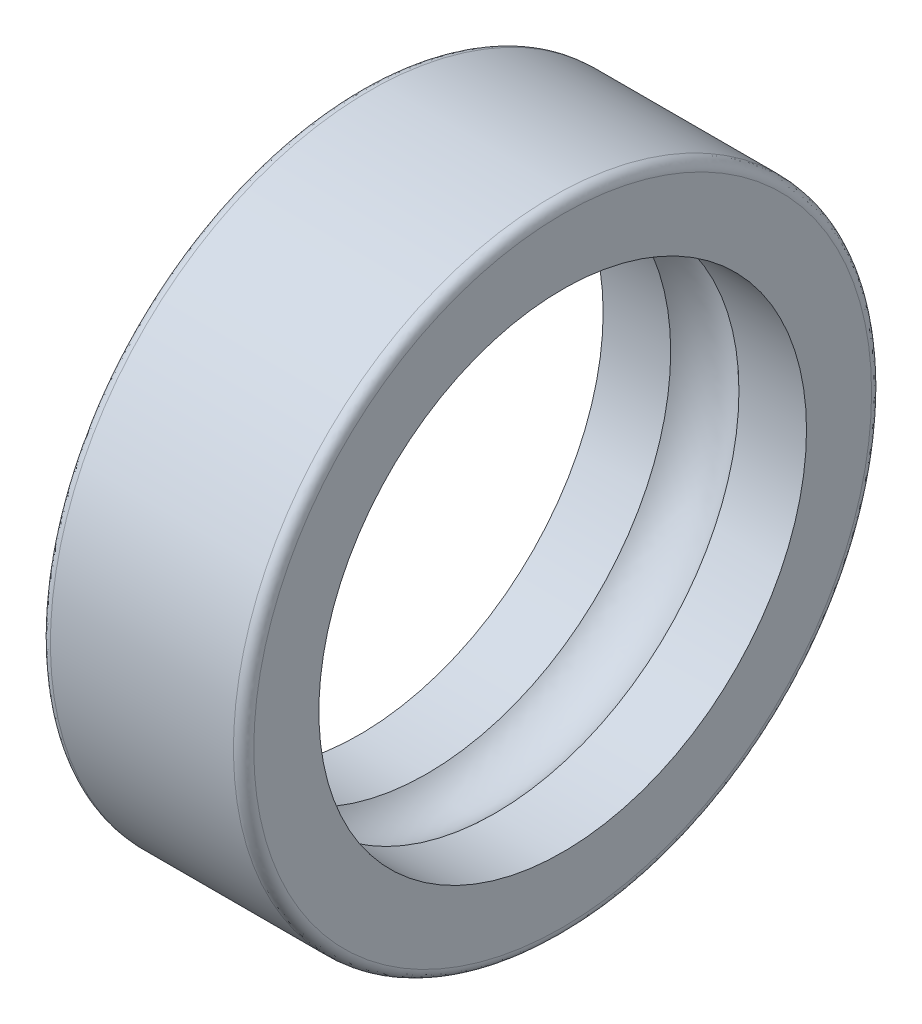
ISO-10303-21;
HEADER;
FILE_DESCRIPTION(('STEP AP214'),'2;1');
FILE_NAME('part.step','',(''),(''),'','','');
FILE_SCHEMA(('AUTOMOTIVE_DESIGN { 1 0 10303 214 1 1 1 1 }'));
ENDSEC;
DATA;
#1=APPLICATION_CONTEXT('core data for automotive mechanical design processes');
#2=APPLICATION_PROTOCOL_DEFINITION('international standard','automotive_design',2000,#1);
#3=PRODUCT_CONTEXT('',#1,'mechanical');
#4=PRODUCT('Part','Part','',(#3));
#5=PRODUCT_RELATED_PRODUCT_CATEGORY('part','',(#4));
#6=PRODUCT_DEFINITION_FORMATION('','',#4);
#7=PRODUCT_DEFINITION_CONTEXT('part definition',#1,'design');
#8=PRODUCT_DEFINITION('design','',#6,#7);
#9=PRODUCT_DEFINITION_SHAPE('','',#8);
#10=(LENGTH_UNIT() NAMED_UNIT(*) SI_UNIT(.MILLI.,.METRE.));
#11=(NAMED_UNIT(*) PLANE_ANGLE_UNIT() SI_UNIT($,.RADIAN.));
#12=(NAMED_UNIT(*) SI_UNIT($,.STERADIAN.) SOLID_ANGLE_UNIT());
#13=UNCERTAINTY_MEASURE_WITH_UNIT(LENGTH_MEASURE(1.E-05),#10,'distance_accuracy_value','');
#14=(GEOMETRIC_REPRESENTATION_CONTEXT(3) GLOBAL_UNCERTAINTY_ASSIGNED_CONTEXT((#13)) GLOBAL_UNIT_ASSIGNED_CONTEXT((#10,
#11,#12)) REPRESENTATION_CONTEXT('',''));
#15=CARTESIAN_POINT('',(0.,0.,0.));
#16=DIRECTION('',(0.,0.,1.));
#17=DIRECTION('',(1.,0.,0.));
#18=AXIS2_PLACEMENT_3D('',#15,#16,#17);
#19=CARTESIAN_POINT('',(-3.15468,0.,0.));
#20=DIRECTION('',(1.,0.,0.));
#21=DIRECTION('',(0.,0.,-1.));
#22=AXIS2_PLACEMENT_3D('',#19,#20,#21);
#23=CYLINDRICAL_SURFACE('',#22,10.9982);
#24=CARTESIAN_POINT('',(3.15468,0.,0.));
#25=DIRECTION('',(1.,0.,0.));
#26=DIRECTION('',(0.,-1.,0.));
#27=AXIS2_PLACEMENT_3D('',#24,#25,#26);
#28=CIRCLE('',#27,10.9982);
#29=CARTESIAN_POINT('',(3.15468,-10.9982,0.));
#30=VERTEX_POINT('',#29);
#31=EDGE_CURVE('E108',#30,#30,#28,.F.);
#32=ORIENTED_EDGE('',*,*,#31,.T.);
#33=EDGE_LOOP('',(#32));
#34=FACE_BOUND('',#33,.T.);
#35=CARTESIAN_POINT('',(-3.15468,0.,0.));
#36=DIRECTION('',(1.,0.,0.));
#37=DIRECTION('',(0.,-1.,0.));
#38=AXIS2_PLACEMENT_3D('',#35,#36,#37);
#39=CIRCLE('',#38,10.9982);
#40=CARTESIAN_POINT('',(-3.15468,-10.9982,0.));
#41=VERTEX_POINT('',#40);
#42=EDGE_CURVE('E53',#41,#41,#39,.T.);
#43=ORIENTED_EDGE('',*,*,#42,.T.);
#44=EDGE_LOOP('',(#43));
#45=FACE_BOUND('',#44,.T.);
#46=ADVANCED_FACE('F16',(#34,#45),#23,.T.);
#47=CARTESIAN_POINT('',(3.11649065283719,-10.9961134142462,0.));
#48=CARTESIAN_POINT('',(3.35786764141765,-11.0225690560909,0.));
#49=CARTESIAN_POINT('',(3.52956905609089,-10.8508676414176,0.));
#50=CARTESIAN_POINT('',(3.50311341424621,-10.6094906528372,0.));
#51=(BOUNDED_CURVE() B_SPLINE_CURVE(3,(#47,#48,#49,#50),.UNSPECIFIED.,.F.,
.F.) B_SPLINE_CURVE_WITH_KNOTS((4,4),(0.,1.),
.UNSPECIFIED.) CURVE() GEOMETRIC_REPRESENTATION_ITEM() RATIONAL_B_SPLINE_CURVE((1.,
0.750571881124367,0.750571881124367,1.)) REPRESENTATION_ITEM(''));
#52=CARTESIAN_POINT('',(3.15468,0.,0.));
#53=DIRECTION('',(1.,0.,0.));
#54=AXIS1_PLACEMENT('',#52,#53);
#55=SURFACE_OF_REVOLUTION('',#51,#54);
#56=ORIENTED_EDGE('',*,*,#31,.F.);
#57=EDGE_LOOP('',(#56));
#58=FACE_BOUND('',#57,.T.);
#59=CARTESIAN_POINT('',(3.50519999999999,0.,0.));
#60=DIRECTION('',(-1.,0.,0.));
#61=DIRECTION('',(0.,1.,0.));
#62=AXIS2_PLACEMENT_3D('',#59,#60,#61);
#63=CIRCLE('',#62,10.64768);
#64=CARTESIAN_POINT('',(3.5052,10.64768,0.));
#65=VERTEX_POINT('',#64);
#66=CARTESIAN_POINT('',(3.5052,-10.64768,0.));
#67=VERTEX_POINT('',#66);
#68=EDGE_CURVE('E46',#65,#67,#63,.T.);
#69=ORIENTED_EDGE('',*,*,#68,.T.);
#70=CARTESIAN_POINT('',(3.50519999999999,0.,0.));
#71=DIRECTION('',(-1.,0.,0.));
#72=DIRECTION('',(0.,-1.,0.));
#73=AXIS2_PLACEMENT_3D('',#70,#71,#72);
#74=CIRCLE('',#73,10.64768);
#75=EDGE_CURVE('E49',#67,#65,#74,.T.);
#76=ORIENTED_EDGE('',*,*,#75,.T.);
#77=EDGE_LOOP('',(#69,#76));
#78=FACE_BOUND('',#77,.T.);
#79=ADVANCED_FACE('F50',(#58,#78),#55,.T.);
#80=CARTESIAN_POINT('',(-3.50311341424621,-10.6094906528372,0.));
#81=CARTESIAN_POINT('',(-3.52956905609088,-10.8508676414176,0.));
#82=CARTESIAN_POINT('',(-3.35786764141764,-11.0225690560909,0.));
#83=CARTESIAN_POINT('',(-3.11649065283718,-10.9961134142462,0.));
#84=(BOUNDED_CURVE() B_SPLINE_CURVE(3,(#80,#81,#82,#83),.UNSPECIFIED.,.F.,
.F.) B_SPLINE_CURVE_WITH_KNOTS((4,4),(0.,1.),
.UNSPECIFIED.) CURVE() GEOMETRIC_REPRESENTATION_ITEM() RATIONAL_B_SPLINE_CURVE((1.,
0.750571881124366,0.750571881124366,1.)) REPRESENTATION_ITEM(''));
#85=CARTESIAN_POINT('',(-3.15468,0.,0.));
#86=DIRECTION('',(1.,0.,0.));
#87=AXIS1_PLACEMENT('',#85,#86);
#88=SURFACE_OF_REVOLUTION('',#84,#87);
#89=ORIENTED_EDGE('',*,*,#42,.F.);
#90=EDGE_LOOP('',(#89));
#91=FACE_BOUND('',#90,.T.);
#92=CARTESIAN_POINT('',(-3.50519999999999,0.,0.));
#93=DIRECTION('',(1.,0.,0.));
#94=DIRECTION('',(0.,1.,0.));
#95=AXIS2_PLACEMENT_3D('',#92,#93,#94);
#96=CIRCLE('',#95,10.64768);
#97=CARTESIAN_POINT('',(-3.5052,10.64768,0.));
#98=VERTEX_POINT('',#97);
#99=CARTESIAN_POINT('',(-3.5052,-10.64768,0.));
#100=VERTEX_POINT('',#99);
#101=EDGE_CURVE('E115',#98,#100,#96,.T.);
#102=ORIENTED_EDGE('',*,*,#101,.T.);
#103=CARTESIAN_POINT('',(-3.50519999999999,0.,0.));
#104=DIRECTION('',(1.,0.,0.));
#105=DIRECTION('',(0.,-1.,0.));
#106=AXIS2_PLACEMENT_3D('',#103,#104,#105);
#107=CIRCLE('',#106,10.64768);
#108=EDGE_CURVE('E37',#100,#98,#107,.T.);
#109=ORIENTED_EDGE('',*,*,#108,.T.);
#110=EDGE_LOOP('',(#102,#109));
#111=FACE_BOUND('',#110,.T.);
#112=ADVANCED_FACE('F73',(#91,#111),#88,.T.);
#113=CARTESIAN_POINT('',(3.5052,11.0735872,11.0778155040199));
#114=DIRECTION('',(1.,0.,0.));
#115=DIRECTION('',(0.,-1.,0.));
#116=AXIS2_PLACEMENT_3D('',#113,#114,#115);
#117=PLANE('',#116);
#118=CARTESIAN_POINT('',(3.5052,0.,0.));
#119=DIRECTION('',(1.,0.,0.));
#120=DIRECTION('',(0.,0.,-1.));
#121=AXIS2_PLACEMENT_3D('',#118,#119,#120);
#122=CIRCLE('',#121,8.4049108);
#123=CARTESIAN_POINT('',(3.5052,0.,-8.4049108));
#124=VERTEX_POINT('',#123);
#125=EDGE_CURVE('E118',#124,#124,#122,.F.);
#126=ORIENTED_EDGE('',*,*,#125,.T.);
#127=EDGE_LOOP('',(#126));
#128=FACE_BOUND('',#127,.T.);
#129=ORIENTED_EDGE('',*,*,#75,.F.);
#130=ORIENTED_EDGE('',*,*,#68,.F.);
#131=EDGE_LOOP('',(#129,#130));
#132=FACE_BOUND('',#131,.T.);
#133=ADVANCED_FACE('F56',(#128,#132),#117,.T.);
#134=CARTESIAN_POINT('',(-3.5052,11.0735872,11.0778155040199));
#135=DIRECTION('',(1.,0.,0.));
#136=DIRECTION('',(0.,-1.,0.));
#137=AXIS2_PLACEMENT_3D('',#134,#135,#136);
#138=PLANE('',#137);
#139=CARTESIAN_POINT('',(-3.5052,0.,0.));
#140=DIRECTION('',(1.,0.,0.));
#141=DIRECTION('',(0.,0.,-1.));
#142=AXIS2_PLACEMENT_3D('',#139,#140,#141);
#143=CIRCLE('',#142,8.4049108);
#144=CARTESIAN_POINT('',(-3.5052,0.,-8.4049108));
#145=VERTEX_POINT('',#144);
#146=EDGE_CURVE('E149',#145,#145,#143,.T.);
#147=ORIENTED_EDGE('',*,*,#146,.T.);
#148=EDGE_LOOP('',(#147));
#149=FACE_BOUND('',#148,.T.);
#150=ORIENTED_EDGE('',*,*,#108,.F.);
#151=ORIENTED_EDGE('',*,*,#101,.F.);
#152=EDGE_LOOP('',(#150,#151));
#153=FACE_BOUND('',#152,.T.);
#154=ADVANCED_FACE('F18',(#149,#153),#138,.F.);
#155=CARTESIAN_POINT('',(1.17651034160326,0.,0.));
#156=DIRECTION('',(1.,0.,0.));
#157=DIRECTION('',(0.,0.,-1.));
#158=AXIS2_PLACEMENT_3D('',#155,#156,#157);
#159=CYLINDRICAL_SURFACE('',#158,8.4049108);
#160=ORIENTED_EDGE('',*,*,#125,.F.);
#161=EDGE_LOOP('',(#160));
#162=FACE_BOUND('',#161,.T.);
#163=CARTESIAN_POINT('',(1.17651034160323,0.,0.));
#164=DIRECTION('',(1.,0.,0.));
#165=DIRECTION('',(0.,-1.,0.));
#166=AXIS2_PLACEMENT_3D('',#163,#164,#165);
#167=CIRCLE('',#166,8.40491079999997);
#168=CARTESIAN_POINT('',(1.17651034160323,-8.40491079999997,0.));
#169=VERTEX_POINT('',#168);
#170=EDGE_CURVE('E29',#169,#169,#167,.F.);
#171=ORIENTED_EDGE('',*,*,#170,.T.);
#172=EDGE_LOOP('',(#171));
#173=FACE_BOUND('',#172,.T.);
#174=ADVANCED_FACE('F120',(#162,#173),#159,.F.);
#175=CARTESIAN_POINT('',(-3.5052,0.,0.));
#176=DIRECTION('',(1.,0.,0.));
#177=DIRECTION('',(0.,0.,-1.));
#178=AXIS2_PLACEMENT_3D('',#175,#176,#177);
#179=CYLINDRICAL_SURFACE('',#178,8.4049108);
#180=CARTESIAN_POINT('',(-1.17651034160323,0.,0.));
#181=DIRECTION('',(1.,0.,0.));
#182=DIRECTION('',(0.,-1.,0.));
#183=AXIS2_PLACEMENT_3D('',#180,#181,#182);
#184=CIRCLE('',#183,8.40491079999997);
#185=CARTESIAN_POINT('',(-1.17651034160323,-8.40491079999997,0.));
#186=VERTEX_POINT('',#185);
#187=EDGE_CURVE('E11',#186,#186,#184,.T.);
#188=ORIENTED_EDGE('',*,*,#187,.T.);
#189=EDGE_LOOP('',(#188));
#190=FACE_BOUND('',#189,.T.);
#191=ORIENTED_EDGE('',*,*,#146,.F.);
#192=EDGE_LOOP('',(#191));
#193=FACE_BOUND('',#192,.T.);
#194=ADVANCED_FACE('F126',(#190,#193),#179,.F.);
#195=CARTESIAN_POINT('',(-1.21259923880649,-8.36690169439517,0.));
#196=CARTESIAN_POINT('',(-0.515154192542791,-9.12525898210301,0.));
#197=CARTESIAN_POINT('',(0.515154192542644,-9.12525898210305,0.));
#198=CARTESIAN_POINT('',(1.2125992388064,-8.36690169439527,0.));
#199=(BOUNDED_CURVE() B_SPLINE_CURVE(3,(#195,#196,#197,#198),.UNSPECIFIED.,.F.,
.F.) B_SPLINE_CURVE_WITH_KNOTS((4,4),(0.,1.),
.UNSPECIFIED.) CURVE() GEOMETRIC_REPRESENTATION_ITEM() RATIONAL_B_SPLINE_CURVE((1.,
0.784618958983425,0.784618958983425,1.)) REPRESENTATION_ITEM(''));
#200=CARTESIAN_POINT('',(0.,0.,0.));
#201=DIRECTION('',(1.,0.,0.));
#202=AXIS1_PLACEMENT('',#200,#201);
#203=SURFACE_OF_REVOLUTION('',#199,#202);
#204=ORIENTED_EDGE('',*,*,#170,.F.);
#205=EDGE_LOOP('',(#204));
#206=FACE_BOUND('',#205,.T.);
#207=ORIENTED_EDGE('',*,*,#187,.F.);
#208=EDGE_LOOP('',(#207));
#209=FACE_BOUND('',#208,.T.);
#210=ADVANCED_FACE('F129',(#206,#209),#203,.F.);
#211=CLOSED_SHELL('',(#46,#79,#112,#133,#154,#174,#194,#210));
#212=MANIFOLD_SOLID_BREP('B1',#211);
#213=ADVANCED_BREP_SHAPE_REPRESENTATION('',(#18,#212),#14);
#214=SHAPE_DEFINITION_REPRESENTATION(#9,#213);
ENDSEC;
END-ISO-10303-21;
